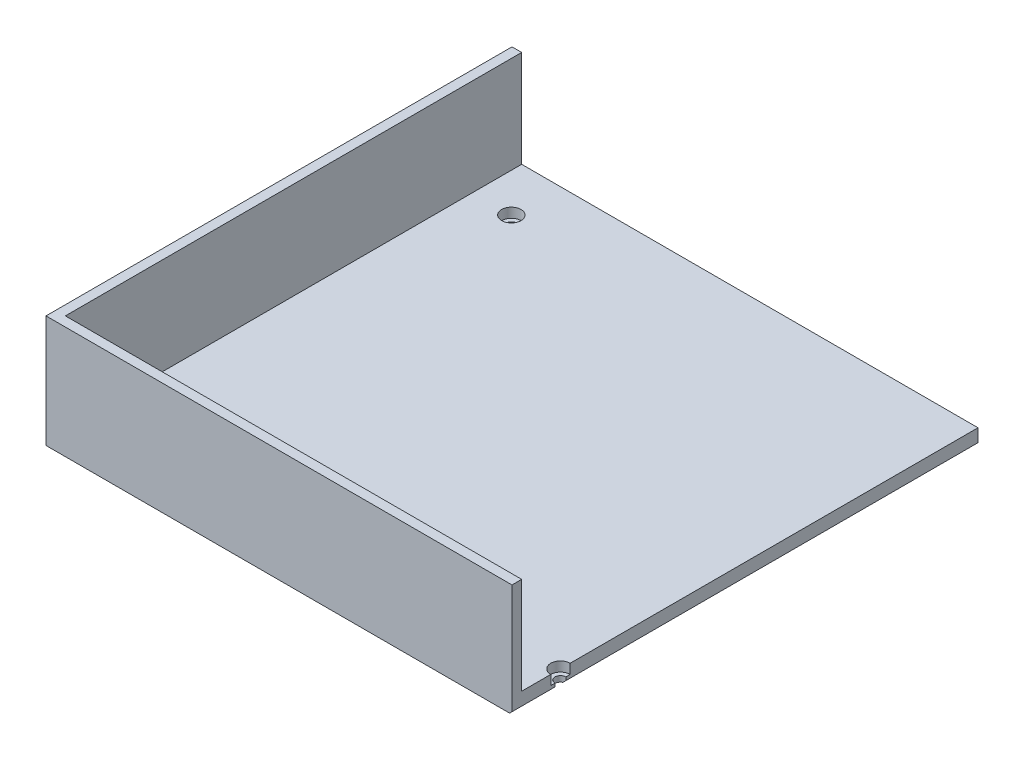
ISO-10303-21;
HEADER;
FILE_DESCRIPTION(('STEP AP214'),'2;1');
FILE_NAME('part.step','',(''),(''),'','','');
FILE_SCHEMA(('AUTOMOTIVE_DESIGN { 1 0 10303 214 1 1 1 1 }'));
ENDSEC;
DATA;
#1=APPLICATION_CONTEXT('core data for automotive mechanical design processes');
#2=APPLICATION_PROTOCOL_DEFINITION('international standard','automotive_design',2000,#1);
#3=PRODUCT_CONTEXT('',#1,'mechanical');
#4=PRODUCT('Part','Part','',(#3));
#5=PRODUCT_RELATED_PRODUCT_CATEGORY('part','',(#4));
#6=PRODUCT_DEFINITION_FORMATION('','',#4);
#7=PRODUCT_DEFINITION_CONTEXT('part definition',#1,'design');
#8=PRODUCT_DEFINITION('design','',#6,#7);
#9=PRODUCT_DEFINITION_SHAPE('','',#8);
#10=(LENGTH_UNIT() NAMED_UNIT(*) SI_UNIT(.MILLI.,.METRE.));
#11=(NAMED_UNIT(*) PLANE_ANGLE_UNIT() SI_UNIT($,.RADIAN.));
#12=(NAMED_UNIT(*) SI_UNIT($,.STERADIAN.) SOLID_ANGLE_UNIT());
#13=UNCERTAINTY_MEASURE_WITH_UNIT(LENGTH_MEASURE(1.E-05),#10,'distance_accuracy_value','');
#14=(GEOMETRIC_REPRESENTATION_CONTEXT(3) GLOBAL_UNCERTAINTY_ASSIGNED_CONTEXT((#13)) GLOBAL_UNIT_ASSIGNED_CONTEXT((#10,
#11,#12)) REPRESENTATION_CONTEXT('',''));
#15=CARTESIAN_POINT('',(0.,0.,0.));
#16=DIRECTION('',(0.,0.,1.));
#17=DIRECTION('',(1.,0.,0.));
#18=AXIS2_PLACEMENT_3D('',#15,#16,#17);
#19=CARTESIAN_POINT('',(96.2,6.35,-96.2));
#20=DIRECTION('',(-1.,0.,0.));
#21=DIRECTION('',(0.,0.,1.));
#22=AXIS2_PLACEMENT_3D('',#19,#20,#21);
#23=PLANE('',#22);
#24=DIRECTION('',(0.,1.,0.));
#25=VECTOR('',#24,1.);
#26=CARTESIAN_POINT('',(96.2,6.35,73.95));
#27=LINE('',#26,#25);
#28=CARTESIAN_POINT('',(96.2,2.35,73.95));
#29=VERTEX_POINT('',#28);
#30=CARTESIAN_POINT('',(96.2,1.,73.95));
#31=VERTEX_POINT('',#30);
#32=EDGE_CURVE('E161',#29,#31,#27,.F.);
#33=ORIENTED_EDGE('',*,*,#32,.T.);
#34=DIRECTION('',(0.,0.,-1.));
#35=VECTOR('',#34,1.);
#36=CARTESIAN_POINT('',(96.2,1.,-96.2));
#37=LINE('',#36,#35);
#38=CARTESIAN_POINT('',(96.2,1.,-96.2));
#39=VERTEX_POINT('',#38);
#40=EDGE_CURVE('E11',#31,#39,#37,.T.);
#41=ORIENTED_EDGE('',*,*,#40,.T.);
#42=DIRECTION('',(0.,-1.,0.));
#43=VECTOR('',#42,1.);
#44=CARTESIAN_POINT('',(96.2,6.35,-96.2));
#45=LINE('',#44,#43);
#46=CARTESIAN_POINT('',(96.2,6.35,-96.2));
#47=VERTEX_POINT('',#46);
#48=EDGE_CURVE('E253',#47,#39,#45,.T.);
#49=ORIENTED_EDGE('',*,*,#48,.F.);
#50=DIRECTION('',(0.,0.,-1.));
#51=VECTOR('',#50,1.);
#52=CARTESIAN_POINT('',(96.2,6.35,-96.2));
#53=LINE('',#52,#51);
#54=CARTESIAN_POINT('',(96.2,6.35,72.2));
#55=VERTEX_POINT('',#54);
#56=EDGE_CURVE('E233',#55,#47,#53,.T.);
#57=ORIENTED_EDGE('',*,*,#56,.F.);
#58=DIRECTION('',(0.,1.,0.));
#59=VECTOR('',#58,1.);
#60=CARTESIAN_POINT('',(96.2,6.35,72.2));
#61=LINE('',#60,#59);
#62=CARTESIAN_POINT('',(96.2,2.35,72.2));
#63=VERTEX_POINT('',#62);
#64=EDGE_CURVE('E261',#55,#63,#61,.F.);
#65=ORIENTED_EDGE('',*,*,#64,.T.);
#66=DIRECTION('',(0.,0.,1.));
#67=VECTOR('',#66,1.);
#68=CARTESIAN_POINT('',(96.2,2.35,-96.2));
#69=LINE('',#68,#67);
#70=EDGE_CURVE('E175',#63,#29,#69,.T.);
#71=ORIENTED_EDGE('',*,*,#70,.T.);
#72=EDGE_LOOP('',(#33,#41,#49,#57,#65,#71));
#73=FACE_BOUND('',#72,.T.);
#74=ADVANCED_FACE('F47',(#73),#23,.F.);
#75=DIRECTION('',(0.,-1.,0.));
#76=VECTOR('',#75,1.);
#77=CARTESIAN_POINT('',(96.2,6.35,96.2));
#78=LINE('',#77,#76);
#79=CARTESIAN_POINT('',(96.2,46.35,96.2));
#80=VERTEX_POINT('',#79);
#81=CARTESIAN_POINT('',(96.2,1.,96.2));
#82=VERTEX_POINT('',#81);
#83=EDGE_CURVE('E236',#80,#82,#78,.T.);
#84=ORIENTED_EDGE('',*,*,#83,.T.);
#85=DIRECTION('',(0.,0.,-1.));
#86=VECTOR('',#85,1.);
#87=CARTESIAN_POINT('',(96.2,1.,-96.2));
#88=LINE('',#87,#86);
#89=CARTESIAN_POINT('',(96.2,1.,78.45));
#90=VERTEX_POINT('',#89);
#91=EDGE_CURVE('E156',#82,#90,#88,.T.);
#92=ORIENTED_EDGE('',*,*,#91,.T.);
#93=DIRECTION('',(0.,1.,0.));
#94=VECTOR('',#93,1.);
#95=CARTESIAN_POINT('',(96.2,6.35,78.45));
#96=LINE('',#95,#94);
#97=CARTESIAN_POINT('',(96.2,2.35,78.45));
#98=VERTEX_POINT('',#97);
#99=EDGE_CURVE('E149',#90,#98,#96,.T.);
#100=ORIENTED_EDGE('',*,*,#99,.T.);
#101=CARTESIAN_POINT('',(96.2,2.35,80.2));
#102=VERTEX_POINT('',#101);
#103=EDGE_CURVE('E154',#98,#102,#69,.T.);
#104=ORIENTED_EDGE('',*,*,#103,.T.);
#105=DIRECTION('',(0.,1.,0.));
#106=VECTOR('',#105,1.);
#107=CARTESIAN_POINT('',(96.2,6.35,80.2));
#108=LINE('',#107,#106);
#109=CARTESIAN_POINT('',(96.2,6.35,80.2));
#110=VERTEX_POINT('',#109);
#111=EDGE_CURVE('E172',#102,#110,#108,.T.);
#112=ORIENTED_EDGE('',*,*,#111,.T.);
#113=CARTESIAN_POINT('',(96.2,6.35,92.1999999999999));
#114=VERTEX_POINT('',#113);
#115=EDGE_CURVE('E228',#114,#110,#53,.T.);
#116=ORIENTED_EDGE('',*,*,#115,.F.);
#117=DIRECTION('',(0.,-1.,0.));
#118=VECTOR('',#117,1.);
#119=CARTESIAN_POINT('',(96.2,46.35,92.2));
#120=LINE('',#119,#118);
#121=CARTESIAN_POINT('',(96.2,46.35,92.2));
#122=VERTEX_POINT('',#121);
#123=EDGE_CURVE('E223',#122,#114,#120,.T.);
#124=ORIENTED_EDGE('',*,*,#123,.F.);
#125=DIRECTION('',(0.,0.,-1.));
#126=VECTOR('',#125,1.);
#127=CARTESIAN_POINT('',(96.2,46.35,92.2));
#128=LINE('',#127,#126);
#129=EDGE_CURVE('E186',#80,#122,#128,.T.);
#130=ORIENTED_EDGE('',*,*,#129,.F.);
#131=EDGE_LOOP('',(#84,#92,#100,#104,#112,#116,#124,#130));
#132=FACE_BOUND('',#131,.T.);
#133=ADVANCED_FACE('F152',(#132),#23,.F.);
#134=CARTESIAN_POINT('',(-96.2,6.35,-96.2));
#135=DIRECTION('',(0.,0.,1.));
#136=DIRECTION('',(1.,0.,0.));
#137=AXIS2_PLACEMENT_3D('',#134,#135,#136);
#138=PLANE('',#137);
#139=ORIENTED_EDGE('',*,*,#48,.T.);
#140=DIRECTION('',(-1.,0.,0.));
#141=VECTOR('',#140,1.);
#142=CARTESIAN_POINT('',(-96.2,1.,-96.2));
#143=LINE('',#142,#141);
#144=CARTESIAN_POINT('',(-96.2,1.,-96.2));
#145=VERTEX_POINT('',#144);
#146=EDGE_CURVE('E286',#39,#145,#143,.T.);
#147=ORIENTED_EDGE('',*,*,#146,.T.);
#148=DIRECTION('',(0.,-1.,0.));
#149=VECTOR('',#148,1.);
#150=CARTESIAN_POINT('',(-96.2,6.35,-96.2));
#151=LINE('',#150,#149);
#152=CARTESIAN_POINT('',(-96.2,46.35,-96.2));
#153=VERTEX_POINT('',#152);
#154=EDGE_CURVE('E249',#153,#145,#151,.T.);
#155=ORIENTED_EDGE('',*,*,#154,.F.);
#156=DIRECTION('',(-1.,0.,0.));
#157=VECTOR('',#156,1.);
#158=CARTESIAN_POINT('',(-92.2,46.35,-96.2));
#159=LINE('',#158,#157);
#160=CARTESIAN_POINT('',(-92.2,46.35,-96.2));
#161=VERTEX_POINT('',#160);
#162=EDGE_CURVE('E197',#161,#153,#159,.T.);
#163=ORIENTED_EDGE('',*,*,#162,.F.);
#164=DIRECTION('',(0.,-1.,0.));
#165=VECTOR('',#164,1.);
#166=CARTESIAN_POINT('',(-92.2,46.35,-96.2));
#167=LINE('',#166,#165);
#168=CARTESIAN_POINT('',(-92.2,6.35,-96.2));
#169=VERTEX_POINT('',#168);
#170=EDGE_CURVE('E209',#161,#169,#167,.T.);
#171=ORIENTED_EDGE('',*,*,#170,.T.);
#172=DIRECTION('',(-1.,0.,0.));
#173=VECTOR('',#172,1.);
#174=CARTESIAN_POINT('',(-96.2,6.35,-96.2));
#175=LINE('',#174,#173);
#176=EDGE_CURVE('E232',#47,#169,#175,.T.);
#177=ORIENTED_EDGE('',*,*,#176,.F.);
#178=EDGE_LOOP('',(#139,#147,#155,#163,#171,#177));
#179=FACE_BOUND('',#178,.T.);
#180=ADVANCED_FACE('F368',(#179),#138,.F.);
#181=CARTESIAN_POINT('',(-96.2,6.35,-96.2));
#182=DIRECTION('',(1.,0.,0.));
#183=DIRECTION('',(0.,0.,-1.));
#184=AXIS2_PLACEMENT_3D('',#181,#182,#183);
#185=PLANE('',#184);
#186=ORIENTED_EDGE('',*,*,#154,.T.);
#187=DIRECTION('',(0.,0.707106781186548,-0.707106781186548));
#188=VECTOR('',#187,1.);
#189=CARTESIAN_POINT('',(-96.2,1.,-96.2));
#190=LINE('',#189,#188);
#191=CARTESIAN_POINT('',(-96.2,0.,-95.2));
#192=VERTEX_POINT('',#191);
#193=EDGE_CURVE('E58',#145,#192,#190,.F.);
#194=ORIENTED_EDGE('',*,*,#193,.T.);
#195=DIRECTION('',(0.,0.,1.));
#196=VECTOR('',#195,1.);
#197=CARTESIAN_POINT('',(-96.2,0.,-96.2));
#198=LINE('',#197,#196);
#199=CARTESIAN_POINT('',(-96.2,0.,96.2));
#200=VERTEX_POINT('',#199);
#201=EDGE_CURVE('E227',#192,#200,#198,.T.);
#202=ORIENTED_EDGE('',*,*,#201,.T.);
#203=DIRECTION('',(0.,-1.,0.));
#204=VECTOR('',#203,1.);
#205=CARTESIAN_POINT('',(-96.2,6.35,96.2));
#206=LINE('',#205,#204);
#207=CARTESIAN_POINT('',(-96.2,46.35,96.2));
#208=VERTEX_POINT('',#207);
#209=EDGE_CURVE('E245',#208,#200,#206,.T.);
#210=ORIENTED_EDGE('',*,*,#209,.F.);
#211=DIRECTION('',(0.,0.,1.));
#212=VECTOR('',#211,1.);
#213=CARTESIAN_POINT('',(-96.2,46.35,-96.2));
#214=LINE('',#213,#212);
#215=EDGE_CURVE('E201',#153,#208,#214,.T.);
#216=ORIENTED_EDGE('',*,*,#215,.F.);
#217=EDGE_LOOP('',(#186,#194,#202,#210,#216));
#218=FACE_BOUND('',#217,.T.);
#219=ADVANCED_FACE('F292',(#218),#185,.F.);
#220=CARTESIAN_POINT('',(-96.2,6.35,96.2));
#221=DIRECTION('',(0.,0.,-1.));
#222=DIRECTION('',(-1.,0.,0.));
#223=AXIS2_PLACEMENT_3D('',#220,#221,#222);
#224=PLANE('',#223);
#225=DIRECTION('',(1.,0.,0.));
#226=VECTOR('',#225,1.);
#227=CARTESIAN_POINT('',(-96.2,0.,96.2));
#228=LINE('',#227,#226);
#229=CARTESIAN_POINT('',(95.2,0.,96.2));
#230=VERTEX_POINT('',#229);
#231=EDGE_CURVE('E239',#200,#230,#228,.T.);
#232=ORIENTED_EDGE('',*,*,#231,.T.);
#233=DIRECTION('',(-0.707106781186548,-0.707106781186548,0.));
#234=VECTOR('',#233,1.);
#235=CARTESIAN_POINT('',(96.2,0.999999999999987,96.2));
#236=LINE('',#235,#234);
#237=EDGE_CURVE('E283',#230,#82,#236,.F.);
#238=ORIENTED_EDGE('',*,*,#237,.T.);
#239=ORIENTED_EDGE('',*,*,#83,.F.);
#240=DIRECTION('',(1.,0.,0.));
#241=VECTOR('',#240,1.);
#242=CARTESIAN_POINT('',(-96.2,46.35,96.2));
#243=LINE('',#242,#241);
#244=EDGE_CURVE('E205',#208,#80,#243,.T.);
#245=ORIENTED_EDGE('',*,*,#244,.F.);
#246=ORIENTED_EDGE('',*,*,#209,.T.);
#247=EDGE_LOOP('',(#232,#238,#239,#245,#246));
#248=FACE_BOUND('',#247,.T.);
#249=ADVANCED_FACE('F375',(#248),#224,.F.);
#250=CARTESIAN_POINT('',(0.,6.35,0.));
#251=DIRECTION('',(0.,1.,0.));
#252=DIRECTION('',(0.,0.,1.));
#253=AXIS2_PLACEMENT_3D('',#250,#251,#252);
#254=PLANE('',#253);
#255=CARTESIAN_POINT('',(-76.2,6.35,76.2));
#256=DIRECTION('',(0.,1.,0.));
#257=DIRECTION('',(0.,0.,1.));
#258=AXIS2_PLACEMENT_3D('',#255,#256,#257);
#259=CIRCLE('',#258,4.);
#260=CARTESIAN_POINT('',(-76.2,6.35,80.2));
#261=VERTEX_POINT('',#260);
#262=EDGE_CURVE('E303',#261,#261,#259,.T.);
#263=ORIENTED_EDGE('',*,*,#262,.F.);
#264=EDGE_LOOP('',(#263));
#265=FACE_BOUND('',#264,.T.);
#266=CARTESIAN_POINT('',(-76.2,6.35,-75.923653979657));
#267=DIRECTION('',(0.,1.,0.));
#268=DIRECTION('',(0.,0.,1.));
#269=AXIS2_PLACEMENT_3D('',#266,#267,#268);
#270=CIRCLE('',#269,4.);
#271=CARTESIAN_POINT('',(-76.2,6.35,-71.923653979657));
#272=VERTEX_POINT('',#271);
#273=EDGE_CURVE('E322',#272,#272,#270,.T.);
#274=ORIENTED_EDGE('',*,*,#273,.F.);
#275=EDGE_LOOP('',(#274));
#276=FACE_BOUND('',#275,.T.);
#277=CARTESIAN_POINT('',(96.2,6.35,76.2));
#278=DIRECTION('',(0.,1.,0.));
#279=DIRECTION('',(0.,0.,1.));
#280=AXIS2_PLACEMENT_3D('',#277,#278,#279);
#281=CIRCLE('',#280,4.);
#282=EDGE_CURVE('E265',#55,#110,#281,.T.);
#283=ORIENTED_EDGE('',*,*,#282,.F.);
#284=ORIENTED_EDGE('',*,*,#56,.T.);
#285=ORIENTED_EDGE('',*,*,#176,.T.);
#286=DIRECTION('',(0.,0.,-1.));
#287=VECTOR('',#286,1.);
#288=CARTESIAN_POINT('',(-92.2,6.35,-92.2));
#289=LINE('',#288,#287);
#290=CARTESIAN_POINT('',(-92.2,6.35,92.2));
#291=VERTEX_POINT('',#290);
#292=EDGE_CURVE('E191',#291,#169,#289,.T.);
#293=ORIENTED_EDGE('',*,*,#292,.F.);
#294=DIRECTION('',(-1.,0.,0.));
#295=VECTOR('',#294,1.);
#296=CARTESIAN_POINT('',(-92.2,6.35,92.2));
#297=LINE('',#296,#295);
#298=EDGE_CURVE('E160',#114,#291,#297,.T.);
#299=ORIENTED_EDGE('',*,*,#298,.F.);
#300=ORIENTED_EDGE('',*,*,#115,.T.);
#301=EDGE_LOOP('',(#283,#284,#285,#293,#299,#300));
#302=FACE_BOUND('',#301,.T.);
#303=ADVANCED_FACE('F344',(#265,#276,#302),#254,.T.);
#304=CARTESIAN_POINT('',(0.,0.,0.));
#305=DIRECTION('',(0.,1.,0.));
#306=DIRECTION('',(0.,0.,1.));
#307=AXIS2_PLACEMENT_3D('',#304,#305,#306);
#308=PLANE('',#307);
#309=CARTESIAN_POINT('',(-76.2,0.,76.2));
#310=DIRECTION('',(0.,1.,0.));
#311=DIRECTION('',(0.,0.,1.));
#312=AXIS2_PLACEMENT_3D('',#309,#310,#311);
#313=CIRCLE('',#312,2.25);
#314=CARTESIAN_POINT('',(-76.2,0.,78.45));
#315=VERTEX_POINT('',#314);
#316=EDGE_CURVE('E318',#315,#315,#313,.T.);
#317=ORIENTED_EDGE('',*,*,#316,.T.);
#318=EDGE_LOOP('',(#317));
#319=FACE_BOUND('',#318,.T.);
#320=CARTESIAN_POINT('',(-76.2,0.,-75.923653979657));
#321=DIRECTION('',(0.,1.,0.));
#322=DIRECTION('',(0.,0.,1.));
#323=AXIS2_PLACEMENT_3D('',#320,#321,#322);
#324=CIRCLE('',#323,2.25);
#325=CARTESIAN_POINT('',(-76.2,0.,-73.673653979657));
#326=VERTEX_POINT('',#325);
#327=EDGE_CURVE('E182',#326,#326,#324,.T.);
#328=ORIENTED_EDGE('',*,*,#327,.T.);
#329=EDGE_LOOP('',(#328));
#330=FACE_BOUND('',#329,.T.);
#331=CARTESIAN_POINT('',(96.2,0.,76.2));
#332=DIRECTION('',(0.,1.,0.));
#333=DIRECTION('',(0.,0.,1.));
#334=AXIS2_PLACEMENT_3D('',#331,#332,#333);
#335=CIRCLE('',#334,2.25);
#336=CARTESIAN_POINT('',(95.2,0.,74.1844355629254));
#337=VERTEX_POINT('',#336);
#338=CARTESIAN_POINT('',(95.2,0.,78.2155644370746));
#339=VERTEX_POINT('',#338);
#340=EDGE_CURVE('E173',#337,#339,#335,.T.);
#341=ORIENTED_EDGE('',*,*,#340,.T.);
#342=DIRECTION('',(0.,0.,1.));
#343=VECTOR('',#342,1.);
#344=CARTESIAN_POINT('',(95.2,0.,0.));
#345=LINE('',#344,#343);
#346=EDGE_CURVE('E280',#339,#230,#345,.T.);
#347=ORIENTED_EDGE('',*,*,#346,.T.);
#348=ORIENTED_EDGE('',*,*,#231,.F.);
#349=ORIENTED_EDGE('',*,*,#201,.F.);
#350=DIRECTION('',(1.,0.,0.));
#351=VECTOR('',#350,1.);
#352=CARTESIAN_POINT('',(0.,0.,-95.2));
#353=LINE('',#352,#351);
#354=CARTESIAN_POINT('',(95.2,0.,-95.2));
#355=VERTEX_POINT('',#354);
#356=EDGE_CURVE('E277',#192,#355,#353,.T.);
#357=ORIENTED_EDGE('',*,*,#356,.T.);
#358=DIRECTION('',(0.,0.,1.));
#359=VECTOR('',#358,1.);
#360=CARTESIAN_POINT('',(95.2,0.,0.));
#361=LINE('',#360,#359);
#362=EDGE_CURVE('E274',#355,#337,#361,.T.);
#363=ORIENTED_EDGE('',*,*,#362,.T.);
#364=EDGE_LOOP('',(#341,#347,#348,#349,#357,#363));
#365=FACE_BOUND('',#364,.T.);
#366=ADVANCED_FACE('F296',(#319,#330,#365),#308,.F.);
#367=CARTESIAN_POINT('',(-92.2,46.35,92.2));
#368=DIRECTION('',(0.,0.,1.));
#369=DIRECTION('',(1.,0.,0.));
#370=AXIS2_PLACEMENT_3D('',#367,#368,#369);
#371=PLANE('',#370);
#372=ORIENTED_EDGE('',*,*,#298,.T.);
#373=DIRECTION('',(0.,-1.,0.));
#374=VECTOR('',#373,1.);
#375=CARTESIAN_POINT('',(-92.2,46.35,92.2));
#376=LINE('',#375,#374);
#377=CARTESIAN_POINT('',(-92.2,46.35,92.2));
#378=VERTEX_POINT('',#377);
#379=EDGE_CURVE('E219',#378,#291,#376,.T.);
#380=ORIENTED_EDGE('',*,*,#379,.F.);
#381=DIRECTION('',(-1.,0.,0.));
#382=VECTOR('',#381,1.);
#383=CARTESIAN_POINT('',(92.2,46.35,92.2));
#384=LINE('',#383,#382);
#385=EDGE_CURVE('E190',#122,#378,#384,.T.);
#386=ORIENTED_EDGE('',*,*,#385,.F.);
#387=ORIENTED_EDGE('',*,*,#123,.T.);
#388=EDGE_LOOP('',(#372,#380,#386,#387));
#389=FACE_BOUND('',#388,.T.);
#390=ADVANCED_FACE('F347',(#389),#371,.F.);
#391=CARTESIAN_POINT('',(-92.2,46.35,-92.2));
#392=DIRECTION('',(-1.,0.,0.));
#393=DIRECTION('',(0.,0.,1.));
#394=AXIS2_PLACEMENT_3D('',#391,#392,#393);
#395=PLANE('',#394);
#396=ORIENTED_EDGE('',*,*,#292,.T.);
#397=ORIENTED_EDGE('',*,*,#170,.F.);
#398=DIRECTION('',(0.,0.,-1.));
#399=VECTOR('',#398,1.);
#400=CARTESIAN_POINT('',(-92.2,46.35,-92.2));
#401=LINE('',#400,#399);
#402=EDGE_CURVE('E194',#378,#161,#401,.T.);
#403=ORIENTED_EDGE('',*,*,#402,.F.);
#404=ORIENTED_EDGE('',*,*,#379,.T.);
#405=EDGE_LOOP('',(#396,#397,#403,#404));
#406=FACE_BOUND('',#405,.T.);
#407=ADVANCED_FACE('F350',(#406),#395,.F.);
#408=CARTESIAN_POINT('',(0.,46.35,0.));
#409=DIRECTION('',(0.,1.,0.));
#410=DIRECTION('',(0.,0.,1.));
#411=AXIS2_PLACEMENT_3D('',#408,#409,#410);
#412=PLANE('',#411);
#413=ORIENTED_EDGE('',*,*,#129,.T.);
#414=ORIENTED_EDGE('',*,*,#385,.T.);
#415=ORIENTED_EDGE('',*,*,#402,.T.);
#416=ORIENTED_EDGE('',*,*,#162,.T.);
#417=ORIENTED_EDGE('',*,*,#215,.T.);
#418=ORIENTED_EDGE('',*,*,#244,.T.);
#419=EDGE_LOOP('',(#413,#414,#415,#416,#417,#418));
#420=FACE_BOUND('',#419,.T.);
#421=ADVANCED_FACE('F354',(#420),#412,.T.);
#422=CARTESIAN_POINT('',(98.45,2.35,76.2));
#423=DIRECTION('',(0.,-1.,0.));
#424=DIRECTION('',(0.,0.,-1.));
#425=AXIS2_PLACEMENT_3D('',#422,#423,#424);
#426=PLANE('',#425);
#427=CARTESIAN_POINT('',(96.2,2.35,76.2));
#428=DIRECTION('',(0.,1.,0.));
#429=DIRECTION('',(0.,0.,1.));
#430=AXIS2_PLACEMENT_3D('',#427,#428,#429);
#431=CIRCLE('',#430,4.);
#432=EDGE_CURVE('E170',#63,#102,#431,.T.);
#433=ORIENTED_EDGE('',*,*,#432,.T.);
#434=ORIENTED_EDGE('',*,*,#103,.F.);
#435=CARTESIAN_POINT('',(96.2,2.35,76.2));
#436=DIRECTION('',(0.,1.,0.));
#437=DIRECTION('',(0.,0.,1.));
#438=AXIS2_PLACEMENT_3D('',#435,#436,#437);
#439=CIRCLE('',#438,2.25);
#440=EDGE_CURVE('E167',#29,#98,#439,.T.);
#441=ORIENTED_EDGE('',*,*,#440,.F.);
#442=ORIENTED_EDGE('',*,*,#70,.F.);
#443=EDGE_LOOP('',(#433,#434,#441,#442));
#444=FACE_BOUND('',#443,.T.);
#445=ADVANCED_FACE('F166',(#444),#426,.F.);
#446=CARTESIAN_POINT('',(96.2,6.35,76.2));
#447=DIRECTION('',(0.,1.,0.));
#448=DIRECTION('',(0.,0.,1.));
#449=AXIS2_PLACEMENT_3D('',#446,#447,#448);
#450=CYLINDRICAL_SURFACE('',#449,4.);
#451=ORIENTED_EDGE('',*,*,#432,.F.);
#452=ORIENTED_EDGE('',*,*,#64,.F.);
#453=ORIENTED_EDGE('',*,*,#282,.T.);
#454=ORIENTED_EDGE('',*,*,#111,.F.);
#455=EDGE_LOOP('',(#451,#452,#453,#454));
#456=FACE_BOUND('',#455,.T.);
#457=ADVANCED_FACE('F339',(#456),#450,.F.);
#458=CARTESIAN_POINT('',(96.2,6.35,76.2));
#459=DIRECTION('',(0.,1.,0.));
#460=DIRECTION('',(0.,0.,1.));
#461=AXIS2_PLACEMENT_3D('',#458,#459,#460);
#462=CYLINDRICAL_SURFACE('',#461,2.25);
#463=ORIENTED_EDGE('',*,*,#99,.F.);
#464=CARTESIAN_POINT('',(96.2,1.,76.2));
#465=DIRECTION('',(-0.707106781186547,0.707106781186547,0.));
#466=DIRECTION('',(0.707106781186548,0.707106781186548,0.));
#467=AXIS2_PLACEMENT_3D('',#464,#465,#466);
#468=ELLIPSE('',#467,3.18198051533947,2.25);
#469=EDGE_CURVE('E271',#90,#339,#468,.F.);
#470=ORIENTED_EDGE('',*,*,#469,.T.);
#471=ORIENTED_EDGE('',*,*,#340,.F.);
#472=CARTESIAN_POINT('',(96.2,1.,76.2));
#473=DIRECTION('',(-0.707106781186547,0.707106781186547,0.));
#474=DIRECTION('',(0.707106781186548,0.707106781186548,0.));
#475=AXIS2_PLACEMENT_3D('',#472,#473,#474);
#476=ELLIPSE('',#475,3.18198051533947,2.25);
#477=EDGE_CURVE('E268',#337,#31,#476,.F.);
#478=ORIENTED_EDGE('',*,*,#477,.T.);
#479=ORIENTED_EDGE('',*,*,#32,.F.);
#480=ORIENTED_EDGE('',*,*,#440,.T.);
#481=EDGE_LOOP('',(#463,#470,#471,#478,#479,#480));
#482=FACE_BOUND('',#481,.T.);
#483=ADVANCED_FACE('F176',(#482),#462,.F.);
#484=CARTESIAN_POINT('',(-76.2,6.35,-75.923653979657));
#485=DIRECTION('',(0.,1.,0.));
#486=DIRECTION('',(0.,0.,1.));
#487=AXIS2_PLACEMENT_3D('',#484,#485,#486);
#488=CYLINDRICAL_SURFACE('',#487,2.25);
#489=ORIENTED_EDGE('',*,*,#327,.F.);
#490=EDGE_LOOP('',(#489));
#491=FACE_BOUND('',#490,.T.);
#492=CARTESIAN_POINT('',(-76.2,2.35,-75.923653979657));
#493=DIRECTION('',(0.,1.,0.));
#494=DIRECTION('',(0.,0.,1.));
#495=AXIS2_PLACEMENT_3D('',#492,#493,#494);
#496=CIRCLE('',#495,2.25);
#497=CARTESIAN_POINT('',(-76.2,2.35,-73.673653979657));
#498=VERTEX_POINT('',#497);
#499=EDGE_CURVE('E330',#498,#498,#496,.T.);
#500=ORIENTED_EDGE('',*,*,#499,.T.);
#501=EDGE_LOOP('',(#500));
#502=FACE_BOUND('',#501,.T.);
#503=ADVANCED_FACE('F410',(#491,#502),#488,.F.);
#504=CARTESIAN_POINT('',(-73.95,2.35,-75.923653979657));
#505=DIRECTION('',(0.,-1.,0.));
#506=DIRECTION('',(0.,0.,-1.));
#507=AXIS2_PLACEMENT_3D('',#504,#505,#506);
#508=PLANE('',#507);
#509=ORIENTED_EDGE('',*,*,#499,.F.);
#510=EDGE_LOOP('',(#509));
#511=FACE_BOUND('',#510,.T.);
#512=CARTESIAN_POINT('',(-76.2,2.35,-75.923653979657));
#513=DIRECTION('',(0.,1.,0.));
#514=DIRECTION('',(0.,0.,1.));
#515=AXIS2_PLACEMENT_3D('',#512,#513,#514);
#516=CIRCLE('',#515,4.);
#517=CARTESIAN_POINT('',(-76.2,2.35,-71.923653979657));
#518=VERTEX_POINT('',#517);
#519=EDGE_CURVE('E326',#518,#518,#516,.T.);
#520=ORIENTED_EDGE('',*,*,#519,.T.);
#521=EDGE_LOOP('',(#520));
#522=FACE_BOUND('',#521,.T.);
#523=ADVANCED_FACE('F515',(#511,#522),#508,.F.);
#524=CARTESIAN_POINT('',(-76.2,6.35,-75.923653979657));
#525=DIRECTION('',(0.,1.,0.));
#526=DIRECTION('',(0.,0.,1.));
#527=AXIS2_PLACEMENT_3D('',#524,#525,#526);
#528=CYLINDRICAL_SURFACE('',#527,4.);
#529=ORIENTED_EDGE('',*,*,#519,.F.);
#530=EDGE_LOOP('',(#529));
#531=FACE_BOUND('',#530,.T.);
#532=ORIENTED_EDGE('',*,*,#273,.T.);
#533=EDGE_LOOP('',(#532));
#534=FACE_BOUND('',#533,.T.);
#535=ADVANCED_FACE('F524',(#531,#534),#528,.F.);
#536=CARTESIAN_POINT('',(-76.2,6.35,76.2));
#537=DIRECTION('',(0.,1.,0.));
#538=DIRECTION('',(0.,0.,1.));
#539=AXIS2_PLACEMENT_3D('',#536,#537,#538);
#540=CYLINDRICAL_SURFACE('',#539,2.25);
#541=ORIENTED_EDGE('',*,*,#316,.F.);
#542=EDGE_LOOP('',(#541));
#543=FACE_BOUND('',#542,.T.);
#544=CARTESIAN_POINT('',(-76.2,2.35,76.2));
#545=DIRECTION('',(0.,1.,0.));
#546=DIRECTION('',(0.,0.,1.));
#547=AXIS2_PLACEMENT_3D('',#544,#545,#546);
#548=CIRCLE('',#547,2.25);
#549=CARTESIAN_POINT('',(-76.2,2.35,78.45));
#550=VERTEX_POINT('',#549);
#551=EDGE_CURVE('E312',#550,#550,#548,.T.);
#552=ORIENTED_EDGE('',*,*,#551,.T.);
#553=EDGE_LOOP('',(#552));
#554=FACE_BOUND('',#553,.T.);
#555=ADVANCED_FACE('F533',(#543,#554),#540,.F.);
#556=CARTESIAN_POINT('',(-73.95,2.35,76.2));
#557=DIRECTION('',(0.,-1.,0.));
#558=DIRECTION('',(0.,0.,-1.));
#559=AXIS2_PLACEMENT_3D('',#556,#557,#558);
#560=PLANE('',#559);
#561=ORIENTED_EDGE('',*,*,#551,.F.);
#562=EDGE_LOOP('',(#561));
#563=FACE_BOUND('',#562,.T.);
#564=CARTESIAN_POINT('',(-76.2,2.35,76.2));
#565=DIRECTION('',(0.,1.,0.));
#566=DIRECTION('',(0.,0.,1.));
#567=AXIS2_PLACEMENT_3D('',#564,#565,#566);
#568=CIRCLE('',#567,4.);
#569=CARTESIAN_POINT('',(-76.2,2.35,80.2));
#570=VERTEX_POINT('',#569);
#571=EDGE_CURVE('E306',#570,#570,#568,.T.);
#572=ORIENTED_EDGE('',*,*,#571,.T.);
#573=EDGE_LOOP('',(#572));
#574=FACE_BOUND('',#573,.T.);
#575=ADVANCED_FACE('F542',(#563,#574),#560,.F.);
#576=CARTESIAN_POINT('',(-76.2,6.35,76.2));
#577=DIRECTION('',(0.,1.,0.));
#578=DIRECTION('',(0.,0.,1.));
#579=AXIS2_PLACEMENT_3D('',#576,#577,#578);
#580=CYLINDRICAL_SURFACE('',#579,4.);
#581=ORIENTED_EDGE('',*,*,#571,.F.);
#582=EDGE_LOOP('',(#581));
#583=FACE_BOUND('',#582,.T.);
#584=ORIENTED_EDGE('',*,*,#262,.T.);
#585=EDGE_LOOP('',(#584));
#586=FACE_BOUND('',#585,.T.);
#587=ADVANCED_FACE('F387',(#583,#586),#580,.F.);
#588=CARTESIAN_POINT('',(96.2,1.,-96.2));
#589=DIRECTION('',(-0.707106781186547,0.707106781186547,0.));
#590=DIRECTION('',(0.,0.,-1.));
#591=AXIS2_PLACEMENT_3D('',#588,#589,#590);
#592=PLANE('',#591);
#593=ORIENTED_EDGE('',*,*,#237,.F.);
#594=ORIENTED_EDGE('',*,*,#346,.F.);
#595=ORIENTED_EDGE('',*,*,#469,.F.);
#596=ORIENTED_EDGE('',*,*,#91,.F.);
#597=EDGE_LOOP('',(#593,#594,#595,#596));
#598=FACE_BOUND('',#597,.T.);
#599=ADVANCED_FACE('F360',(#598),#592,.F.);
#600=CARTESIAN_POINT('',(96.2,1.,-96.2));
#601=DIRECTION('',(-0.707106781186547,0.707106781186547,0.));
#602=DIRECTION('',(0.,0.,-1.));
#603=AXIS2_PLACEMENT_3D('',#600,#601,#602);
#604=PLANE('',#603);
#605=ORIENTED_EDGE('',*,*,#477,.F.);
#606=ORIENTED_EDGE('',*,*,#362,.F.);
#607=DIRECTION('',(0.577350269189626,0.577350269189626,-0.577350269189626));
#608=VECTOR('',#607,1.);
#609=CARTESIAN_POINT('',(96.2,1.,-96.2));
#610=LINE('',#609,#608);
#611=EDGE_CURVE('E52',#39,#355,#610,.F.);
#612=ORIENTED_EDGE('',*,*,#611,.F.);
#613=ORIENTED_EDGE('',*,*,#40,.F.);
#614=EDGE_LOOP('',(#605,#606,#612,#613));
#615=FACE_BOUND('',#614,.T.);
#616=ADVANCED_FACE('F50',(#615),#604,.F.);
#617=CARTESIAN_POINT('',(-96.2,1.,-96.2));
#618=DIRECTION('',(0.,0.707106781186547,0.707106781186547));
#619=DIRECTION('',(-1.,0.,0.));
#620=AXIS2_PLACEMENT_3D('',#617,#618,#619);
#621=PLANE('',#620);
#622=ORIENTED_EDGE('',*,*,#611,.T.);
#623=ORIENTED_EDGE('',*,*,#356,.F.);
#624=ORIENTED_EDGE('',*,*,#193,.F.);
#625=ORIENTED_EDGE('',*,*,#146,.F.);
#626=EDGE_LOOP('',(#622,#623,#624,#625));
#627=FACE_BOUND('',#626,.T.);
#628=ADVANCED_FACE('F299',(#627),#621,.F.);
#629=CLOSED_SHELL('',(#74,#133,#180,#219,#249,#303,#366,#390,#407,#421,#445,#457,#483,#503,#523,
#535,#555,#575,#587,#599,#616,#628));
#630=MANIFOLD_SOLID_BREP('B2',#629);
#631=ADVANCED_BREP_SHAPE_REPRESENTATION('',(#18,#630),#14);
#632=SHAPE_DEFINITION_REPRESENTATION(#9,#631);
ENDSEC;
END-ISO-10303-21;
